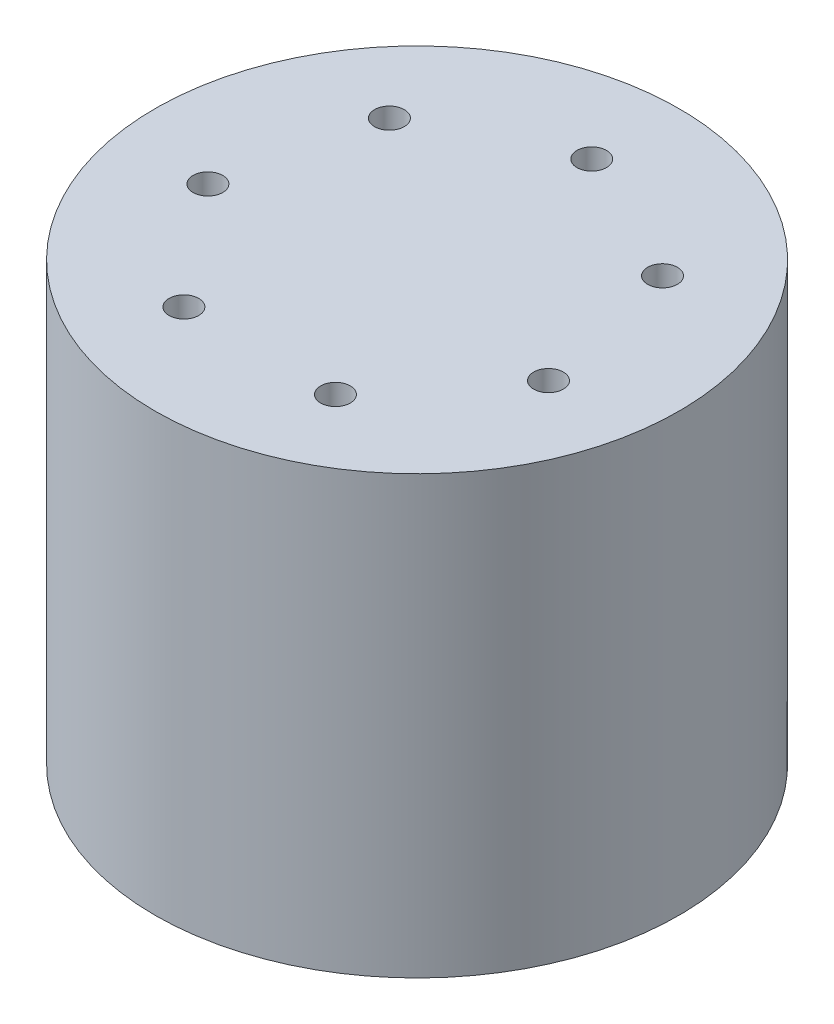
ISO-10303-21;
HEADER;
FILE_DESCRIPTION(('STEP AP214'),'2;1');
FILE_NAME('part.step','',(''),(''),'','','');
FILE_SCHEMA(('AUTOMOTIVE_DESIGN { 1 0 10303 214 1 1 1 1 }'));
ENDSEC;
DATA;
#1=APPLICATION_CONTEXT('core data for automotive mechanical design processes');
#2=APPLICATION_PROTOCOL_DEFINITION('international standard','automotive_design',2000,#1);
#3=PRODUCT_CONTEXT('',#1,'mechanical');
#4=PRODUCT('Part','Part','',(#3));
#5=PRODUCT_RELATED_PRODUCT_CATEGORY('part','',(#4));
#6=PRODUCT_DEFINITION_FORMATION('','',#4);
#7=PRODUCT_DEFINITION_CONTEXT('part definition',#1,'design');
#8=PRODUCT_DEFINITION('design','',#6,#7);
#9=PRODUCT_DEFINITION_SHAPE('','',#8);
#10=(LENGTH_UNIT() NAMED_UNIT(*) SI_UNIT(.MILLI.,.METRE.));
#11=(NAMED_UNIT(*) PLANE_ANGLE_UNIT() SI_UNIT($,.RADIAN.));
#12=(NAMED_UNIT(*) SI_UNIT($,.STERADIAN.) SOLID_ANGLE_UNIT());
#13=UNCERTAINTY_MEASURE_WITH_UNIT(LENGTH_MEASURE(1.E-05),#10,'distance_accuracy_value','');
#14=(GEOMETRIC_REPRESENTATION_CONTEXT(3) GLOBAL_UNCERTAINTY_ASSIGNED_CONTEXT((#13)) GLOBAL_UNIT_ASSIGNED_CONTEXT((#10,
#11,#12)) REPRESENTATION_CONTEXT('',''));
#15=CARTESIAN_POINT('',(0.,0.,0.));
#16=DIRECTION('',(0.,0.,1.));
#17=DIRECTION('',(1.,0.,0.));
#18=AXIS2_PLACEMENT_3D('',#15,#16,#17);
#19=CARTESIAN_POINT('',(0.,100.,0.));
#20=DIRECTION('',(0.,-1.,0.));
#21=DIRECTION('',(0.,0.,-1.));
#22=AXIS2_PLACEMENT_3D('',#19,#20,#21);
#23=CYLINDRICAL_SURFACE('',#22,60.);
#24=CARTESIAN_POINT('',(0.,100.,0.));
#25=DIRECTION('',(0.,1.,0.));
#26=DIRECTION('',(0.,0.,1.));
#27=AXIS2_PLACEMENT_3D('',#24,#25,#26);
#28=CIRCLE('',#27,60.);
#29=CARTESIAN_POINT('',(0.,100.,60.));
#30=VERTEX_POINT('',#29);
#31=EDGE_CURVE('E11',#30,#30,#28,.T.);
#32=ORIENTED_EDGE('',*,*,#31,.F.);
#33=EDGE_LOOP('',(#32));
#34=FACE_BOUND('',#33,.T.);
#35=CARTESIAN_POINT('',(0.,0.,0.));
#36=DIRECTION('',(0.,1.,0.));
#37=DIRECTION('',(0.,0.,1.));
#38=AXIS2_PLACEMENT_3D('',#35,#36,#37);
#39=CIRCLE('',#38,60.);
#40=CARTESIAN_POINT('',(0.,0.,60.));
#41=VERTEX_POINT('',#40);
#42=EDGE_CURVE('E42',#41,#41,#39,.T.);
#43=ORIENTED_EDGE('',*,*,#42,.T.);
#44=EDGE_LOOP('',(#43));
#45=FACE_BOUND('',#44,.T.);
#46=ADVANCED_FACE('F39',(#34,#45),#23,.T.);
#47=CARTESIAN_POINT('',(0.,100.,0.));
#48=DIRECTION('',(0.,1.,0.));
#49=DIRECTION('',(0.,0.,1.));
#50=AXIS2_PLACEMENT_3D('',#47,#48,#49);
#51=PLANE('',#50);
#52=CARTESIAN_POINT('',(0.,100.,-40.));
#53=DIRECTION('',(0.,1.,0.));
#54=DIRECTION('',(0.,0.,1.));
#55=AXIS2_PLACEMENT_3D('',#52,#53,#54);
#56=CIRCLE('',#55,3.4);
#57=CARTESIAN_POINT('',(0.,100.,-36.6));
#58=VERTEX_POINT('',#57);
#59=EDGE_CURVE('E79',#58,#58,#56,.T.);
#60=ORIENTED_EDGE('',*,*,#59,.F.);
#61=EDGE_LOOP('',(#60));
#62=FACE_BOUND('',#61,.T.);
#63=CARTESIAN_POINT('',(31.2732592987212,100.,-24.9395920743493));
#64=DIRECTION('',(0.,1.,0.));
#65=DIRECTION('',(0.,0.,1.));
#66=AXIS2_PLACEMENT_3D('',#63,#64,#65);
#67=CIRCLE('',#66,3.4);
#68=CARTESIAN_POINT('',(31.2732592987212,100.,-21.5395920743493));
#69=VERTEX_POINT('',#68);
#70=EDGE_CURVE('E78',#69,#69,#67,.T.);
#71=ORIENTED_EDGE('',*,*,#70,.F.);
#72=EDGE_LOOP('',(#71));
#73=FACE_BOUND('',#72,.T.);
#74=CARTESIAN_POINT('',(38.9971164872729,100.,8.90083735825257));
#75=DIRECTION('',(0.,1.,0.));
#76=DIRECTION('',(0.,0.,1.));
#77=AXIS2_PLACEMENT_3D('',#74,#75,#76);
#78=CIRCLE('',#77,3.4);
#79=CARTESIAN_POINT('',(38.9971164872729,100.,12.3008373582526));
#80=VERTEX_POINT('',#79);
#81=EDGE_CURVE('E89',#80,#80,#78,.T.);
#82=ORIENTED_EDGE('',*,*,#81,.F.);
#83=EDGE_LOOP('',(#82));
#84=FACE_BOUND('',#83,.T.);
#85=CARTESIAN_POINT('',(17.3553495647023,100.,36.0387547160968));
#86=DIRECTION('',(0.,1.,0.));
#87=DIRECTION('',(0.,0.,1.));
#88=AXIS2_PLACEMENT_3D('',#85,#86,#87);
#89=CIRCLE('',#88,3.4);
#90=CARTESIAN_POINT('',(17.3553495647023,100.,39.4387547160968));
#91=VERTEX_POINT('',#90);
#92=EDGE_CURVE('E95',#91,#91,#89,.T.);
#93=ORIENTED_EDGE('',*,*,#92,.F.);
#94=EDGE_LOOP('',(#93));
#95=FACE_BOUND('',#94,.T.);
#96=CARTESIAN_POINT('',(-17.3553495647023,100.,36.0387547160968));
#97=DIRECTION('',(0.,1.,0.));
#98=DIRECTION('',(0.,0.,1.));
#99=AXIS2_PLACEMENT_3D('',#96,#97,#98);
#100=CIRCLE('',#99,3.4);
#101=CARTESIAN_POINT('',(-17.3553495647023,100.,39.4387547160968));
#102=VERTEX_POINT('',#101);
#103=EDGE_CURVE('E101',#102,#102,#100,.T.);
#104=ORIENTED_EDGE('',*,*,#103,.F.);
#105=EDGE_LOOP('',(#104));
#106=FACE_BOUND('',#105,.T.);
#107=CARTESIAN_POINT('',(-38.9971164872729,100.,8.90083735825258));
#108=DIRECTION('',(0.,1.,0.));
#109=DIRECTION('',(0.,0.,1.));
#110=AXIS2_PLACEMENT_3D('',#107,#108,#109);
#111=CIRCLE('',#110,3.4);
#112=CARTESIAN_POINT('',(-38.9971164872729,100.,12.3008373582526));
#113=VERTEX_POINT('',#112);
#114=EDGE_CURVE('E107',#113,#113,#111,.T.);
#115=ORIENTED_EDGE('',*,*,#114,.F.);
#116=EDGE_LOOP('',(#115));
#117=FACE_BOUND('',#116,.T.);
#118=CARTESIAN_POINT('',(-31.2732592987212,100.,-24.9395920743493));
#119=DIRECTION('',(0.,1.,0.));
#120=DIRECTION('',(0.,0.,1.));
#121=AXIS2_PLACEMENT_3D('',#118,#119,#120);
#122=CIRCLE('',#121,3.4);
#123=CARTESIAN_POINT('',(-31.2732592987212,100.,-21.5395920743493));
#124=VERTEX_POINT('',#123);
#125=EDGE_CURVE('E113',#124,#124,#122,.T.);
#126=ORIENTED_EDGE('',*,*,#125,.F.);
#127=EDGE_LOOP('',(#126));
#128=FACE_BOUND('',#127,.T.);
#129=ORIENTED_EDGE('',*,*,#31,.T.);
#130=EDGE_LOOP('',(#129));
#131=FACE_BOUND('',#130,.T.);
#132=ADVANCED_FACE('F127',(#62,#73,#84,#95,#106,#117,#128,#131),#51,.T.);
#133=CARTESIAN_POINT('',(0.,0.,0.));
#134=DIRECTION('',(0.,1.,0.));
#135=DIRECTION('',(0.,0.,1.));
#136=AXIS2_PLACEMENT_3D('',#133,#134,#135);
#137=PLANE('',#136);
#138=ORIENTED_EDGE('',*,*,#42,.F.);
#139=EDGE_LOOP('',(#138));
#140=FACE_BOUND('',#139,.T.);
#141=ADVANCED_FACE('F124',(#140),#137,.F.);
#142=CARTESIAN_POINT('',(-31.2732592987212,77.75,-24.9395920743493));
#143=DIRECTION('',(0.,1.,0.));
#144=DIRECTION('',(0.,0.,1.));
#145=AXIS2_PLACEMENT_3D('',#142,#143,#144);
#146=CONICAL_SURFACE('',#145,3.4,1.02974425867665);
#147=CARTESIAN_POINT('',(-31.2732592987212,75.7070738953063,-24.9395920743493));
#148=VERTEX_POINT('',#147);
#149=VERTEX_LOOP('',#148);
#150=FACE_BOUND('',#149,.T.);
#151=CARTESIAN_POINT('',(-31.2732592987212,77.75,-24.9395920743493));
#152=DIRECTION('',(0.,1.,0.));
#153=DIRECTION('',(0.,0.,1.));
#154=AXIS2_PLACEMENT_3D('',#151,#152,#153);
#155=CIRCLE('',#154,3.4);
#156=CARTESIAN_POINT('',(-31.2732592987212,77.75,-21.5395920743493));
#157=VERTEX_POINT('',#156);
#158=EDGE_CURVE('E116',#157,#157,#155,.T.);
#159=ORIENTED_EDGE('',*,*,#158,.T.);
#160=EDGE_LOOP('',(#159));
#161=FACE_BOUND('',#160,.T.);
#162=ADVANCED_FACE('F126',(#150,#161),#146,.F.);
#163=CARTESIAN_POINT('',(-31.2732592987212,100.,-24.9395920743493));
#164=DIRECTION('',(0.,1.,0.));
#165=DIRECTION('',(0.,0.,1.));
#166=AXIS2_PLACEMENT_3D('',#163,#164,#165);
#167=CYLINDRICAL_SURFACE('',#166,3.4);
#168=ORIENTED_EDGE('',*,*,#158,.F.);
#169=EDGE_LOOP('',(#168));
#170=FACE_BOUND('',#169,.T.);
#171=ORIENTED_EDGE('',*,*,#125,.T.);
#172=EDGE_LOOP('',(#171));
#173=FACE_BOUND('',#172,.T.);
#174=ADVANCED_FACE('F132',(#170,#173),#167,.F.);
#175=CARTESIAN_POINT('',(-38.9971164872729,77.75,8.90083735825258));
#176=DIRECTION('',(0.,1.,0.));
#177=DIRECTION('',(0.,0.,1.));
#178=AXIS2_PLACEMENT_3D('',#175,#176,#177);
#179=CONICAL_SURFACE('',#178,3.39999999999999,1.02974425867665);
#180=CARTESIAN_POINT('',(-38.9971164872729,75.7070738953063,8.90083735825258));
#181=VERTEX_POINT('',#180);
#182=VERTEX_LOOP('',#181);
#183=FACE_BOUND('',#182,.T.);
#184=CARTESIAN_POINT('',(-38.9971164872729,77.75,8.90083735825258));
#185=DIRECTION('',(0.,1.,0.));
#186=DIRECTION('',(0.,0.,1.));
#187=AXIS2_PLACEMENT_3D('',#184,#185,#186);
#188=CIRCLE('',#187,3.39999999999999);
#189=CARTESIAN_POINT('',(-38.9971164872729,77.75,12.3008373582526));
#190=VERTEX_POINT('',#189);
#191=EDGE_CURVE('E110',#190,#190,#188,.T.);
#192=ORIENTED_EDGE('',*,*,#191,.T.);
#193=EDGE_LOOP('',(#192));
#194=FACE_BOUND('',#193,.T.);
#195=ADVANCED_FACE('F239',(#183,#194),#179,.F.);
#196=CARTESIAN_POINT('',(-38.9971164872729,100.,8.90083735825258));
#197=DIRECTION('',(0.,1.,0.));
#198=DIRECTION('',(0.,0.,1.));
#199=AXIS2_PLACEMENT_3D('',#196,#197,#198);
#200=CYLINDRICAL_SURFACE('',#199,3.4);
#201=ORIENTED_EDGE('',*,*,#191,.F.);
#202=EDGE_LOOP('',(#201));
#203=FACE_BOUND('',#202,.T.);
#204=ORIENTED_EDGE('',*,*,#114,.T.);
#205=EDGE_LOOP('',(#204));
#206=FACE_BOUND('',#205,.T.);
#207=ADVANCED_FACE('F230',(#203,#206),#200,.F.);
#208=CARTESIAN_POINT('',(-17.3553495647023,77.75,36.0387547160968));
#209=DIRECTION('',(0.,1.,0.));
#210=DIRECTION('',(0.,0.,1.));
#211=AXIS2_PLACEMENT_3D('',#208,#209,#210);
#212=CONICAL_SURFACE('',#211,3.4,1.02974425867665);
#213=CARTESIAN_POINT('',(-17.3553495647023,75.7070738953063,36.0387547160968));
#214=VERTEX_POINT('',#213);
#215=VERTEX_LOOP('',#214);
#216=FACE_BOUND('',#215,.T.);
#217=CARTESIAN_POINT('',(-17.3553495647023,77.75,36.0387547160968));
#218=DIRECTION('',(0.,1.,0.));
#219=DIRECTION('',(0.,0.,1.));
#220=AXIS2_PLACEMENT_3D('',#217,#218,#219);
#221=CIRCLE('',#220,3.4);
#222=CARTESIAN_POINT('',(-17.3553495647023,77.75,39.4387547160968));
#223=VERTEX_POINT('',#222);
#224=EDGE_CURVE('E104',#223,#223,#221,.T.);
#225=ORIENTED_EDGE('',*,*,#224,.T.);
#226=EDGE_LOOP('',(#225));
#227=FACE_BOUND('',#226,.T.);
#228=ADVANCED_FACE('F221',(#216,#227),#212,.F.);
#229=CARTESIAN_POINT('',(-17.3553495647023,100.,36.0387547160968));
#230=DIRECTION('',(0.,1.,0.));
#231=DIRECTION('',(0.,0.,1.));
#232=AXIS2_PLACEMENT_3D('',#229,#230,#231);
#233=CYLINDRICAL_SURFACE('',#232,3.4);
#234=ORIENTED_EDGE('',*,*,#224,.F.);
#235=EDGE_LOOP('',(#234));
#236=FACE_BOUND('',#235,.T.);
#237=ORIENTED_EDGE('',*,*,#103,.T.);
#238=EDGE_LOOP('',(#237));
#239=FACE_BOUND('',#238,.T.);
#240=ADVANCED_FACE('F212',(#236,#239),#233,.F.);
#241=CARTESIAN_POINT('',(17.3553495647023,77.75,36.0387547160968));
#242=DIRECTION('',(0.,1.,0.));
#243=DIRECTION('',(0.,0.,1.));
#244=AXIS2_PLACEMENT_3D('',#241,#242,#243);
#245=CONICAL_SURFACE('',#244,3.4,1.02974425867665);
#246=CARTESIAN_POINT('',(17.3553495647023,75.7070738953063,36.0387547160968));
#247=VERTEX_POINT('',#246);
#248=VERTEX_LOOP('',#247);
#249=FACE_BOUND('',#248,.T.);
#250=CARTESIAN_POINT('',(17.3553495647023,77.75,36.0387547160968));
#251=DIRECTION('',(0.,1.,0.));
#252=DIRECTION('',(0.,0.,1.));
#253=AXIS2_PLACEMENT_3D('',#250,#251,#252);
#254=CIRCLE('',#253,3.4);
#255=CARTESIAN_POINT('',(17.3553495647023,77.75,39.4387547160968));
#256=VERTEX_POINT('',#255);
#257=EDGE_CURVE('E98',#256,#256,#254,.T.);
#258=ORIENTED_EDGE('',*,*,#257,.T.);
#259=EDGE_LOOP('',(#258));
#260=FACE_BOUND('',#259,.T.);
#261=ADVANCED_FACE('F203',(#249,#260),#245,.F.);
#262=CARTESIAN_POINT('',(17.3553495647023,100.,36.0387547160968));
#263=DIRECTION('',(0.,1.,0.));
#264=DIRECTION('',(0.,0.,1.));
#265=AXIS2_PLACEMENT_3D('',#262,#263,#264);
#266=CYLINDRICAL_SURFACE('',#265,3.4);
#267=ORIENTED_EDGE('',*,*,#257,.F.);
#268=EDGE_LOOP('',(#267));
#269=FACE_BOUND('',#268,.T.);
#270=ORIENTED_EDGE('',*,*,#92,.T.);
#271=EDGE_LOOP('',(#270));
#272=FACE_BOUND('',#271,.T.);
#273=ADVANCED_FACE('F194',(#269,#272),#266,.F.);
#274=CARTESIAN_POINT('',(38.9971164872729,77.75,8.90083735825257));
#275=DIRECTION('',(0.,1.,0.));
#276=DIRECTION('',(0.,0.,1.));
#277=AXIS2_PLACEMENT_3D('',#274,#275,#276);
#278=CONICAL_SURFACE('',#277,3.39999999999999,1.02974425867665);
#279=CARTESIAN_POINT('',(38.9971164872729,75.7070738953063,8.90083735825257));
#280=VERTEX_POINT('',#279);
#281=VERTEX_LOOP('',#280);
#282=FACE_BOUND('',#281,.T.);
#283=CARTESIAN_POINT('',(38.9971164872729,77.75,8.90083735825257));
#284=DIRECTION('',(0.,1.,0.));
#285=DIRECTION('',(0.,0.,1.));
#286=AXIS2_PLACEMENT_3D('',#283,#284,#285);
#287=CIRCLE('',#286,3.39999999999999);
#288=CARTESIAN_POINT('',(38.9971164872729,77.75,12.3008373582526));
#289=VERTEX_POINT('',#288);
#290=EDGE_CURVE('E92',#289,#289,#287,.T.);
#291=ORIENTED_EDGE('',*,*,#290,.T.);
#292=EDGE_LOOP('',(#291));
#293=FACE_BOUND('',#292,.T.);
#294=ADVANCED_FACE('F185',(#282,#293),#278,.F.);
#295=CARTESIAN_POINT('',(38.9971164872729,100.,8.90083735825257));
#296=DIRECTION('',(0.,1.,0.));
#297=DIRECTION('',(0.,0.,1.));
#298=AXIS2_PLACEMENT_3D('',#295,#296,#297);
#299=CYLINDRICAL_SURFACE('',#298,3.4);
#300=ORIENTED_EDGE('',*,*,#290,.F.);
#301=EDGE_LOOP('',(#300));
#302=FACE_BOUND('',#301,.T.);
#303=ORIENTED_EDGE('',*,*,#81,.T.);
#304=EDGE_LOOP('',(#303));
#305=FACE_BOUND('',#304,.T.);
#306=ADVANCED_FACE('F176',(#302,#305),#299,.F.);
#307=CARTESIAN_POINT('',(31.2732592987212,77.75,-24.9395920743493));
#308=DIRECTION('',(0.,1.,0.));
#309=DIRECTION('',(0.,0.,1.));
#310=AXIS2_PLACEMENT_3D('',#307,#308,#309);
#311=CONICAL_SURFACE('',#310,3.39999999999999,1.02974425867665);
#312=CARTESIAN_POINT('',(31.2732592987212,75.7070738953063,-24.9395920743493));
#313=VERTEX_POINT('',#312);
#314=VERTEX_LOOP('',#313);
#315=FACE_BOUND('',#314,.T.);
#316=CARTESIAN_POINT('',(31.2732592987212,77.75,-24.9395920743493));
#317=DIRECTION('',(0.,1.,0.));
#318=DIRECTION('',(0.,0.,1.));
#319=AXIS2_PLACEMENT_3D('',#316,#317,#318);
#320=CIRCLE('',#319,3.39999999999999);
#321=CARTESIAN_POINT('',(31.2732592987212,77.75,-21.5395920743494));
#322=VERTEX_POINT('',#321);
#323=EDGE_CURVE('E82',#322,#322,#320,.T.);
#324=ORIENTED_EDGE('',*,*,#323,.T.);
#325=EDGE_LOOP('',(#324));
#326=FACE_BOUND('',#325,.T.);
#327=ADVANCED_FACE('F169',(#315,#326),#311,.F.);
#328=CARTESIAN_POINT('',(31.2732592987212,100.,-24.9395920743493));
#329=DIRECTION('',(0.,1.,0.));
#330=DIRECTION('',(0.,0.,1.));
#331=AXIS2_PLACEMENT_3D('',#328,#329,#330);
#332=CYLINDRICAL_SURFACE('',#331,3.4);
#333=ORIENTED_EDGE('',*,*,#323,.F.);
#334=EDGE_LOOP('',(#333));
#335=FACE_BOUND('',#334,.T.);
#336=ORIENTED_EDGE('',*,*,#70,.T.);
#337=EDGE_LOOP('',(#336));
#338=FACE_BOUND('',#337,.T.);
#339=ADVANCED_FACE('F72',(#335,#338),#332,.F.);
#340=CARTESIAN_POINT('',(0.,77.75,-40.));
#341=DIRECTION('',(0.,1.,0.));
#342=DIRECTION('',(0.,0.,1.));
#343=AXIS2_PLACEMENT_3D('',#340,#341,#342);
#344=CONICAL_SURFACE('',#343,3.4,1.02974425867665);
#345=CARTESIAN_POINT('',(0.,75.7070738953063,-40.));
#346=VERTEX_POINT('',#345);
#347=VERTEX_LOOP('',#346);
#348=FACE_BOUND('',#347,.T.);
#349=CARTESIAN_POINT('',(0.,77.75,-40.));
#350=DIRECTION('',(0.,1.,0.));
#351=DIRECTION('',(0.,0.,1.));
#352=AXIS2_PLACEMENT_3D('',#349,#350,#351);
#353=CIRCLE('',#352,3.4);
#354=CARTESIAN_POINT('',(0.,77.75,-36.6));
#355=VERTEX_POINT('',#354);
#356=EDGE_CURVE('E76',#355,#355,#353,.T.);
#357=ORIENTED_EDGE('',*,*,#356,.T.);
#358=EDGE_LOOP('',(#357));
#359=FACE_BOUND('',#358,.T.);
#360=ADVANCED_FACE('F68',(#348,#359),#344,.F.);
#361=CARTESIAN_POINT('',(0.,100.,-40.));
#362=DIRECTION('',(0.,1.,0.));
#363=DIRECTION('',(0.,0.,1.));
#364=AXIS2_PLACEMENT_3D('',#361,#362,#363);
#365=CYLINDRICAL_SURFACE('',#364,3.4);
#366=ORIENTED_EDGE('',*,*,#356,.F.);
#367=EDGE_LOOP('',(#366));
#368=FACE_BOUND('',#367,.T.);
#369=ORIENTED_EDGE('',*,*,#59,.T.);
#370=EDGE_LOOP('',(#369));
#371=FACE_BOUND('',#370,.T.);
#372=ADVANCED_FACE('F71',(#368,#371),#365,.F.);
#373=CLOSED_SHELL('',(#46,#132,#141,#162,#174,#195,#207,#228,#240,#261,#273,#294,#306,#327,#339,
#360,#372));
#374=MANIFOLD_SOLID_BREP('B2',#373);
#375=ADVANCED_BREP_SHAPE_REPRESENTATION('',(#18,#374),#14);
#376=SHAPE_DEFINITION_REPRESENTATION(#9,#375);
ENDSEC;
END-ISO-10303-21;
